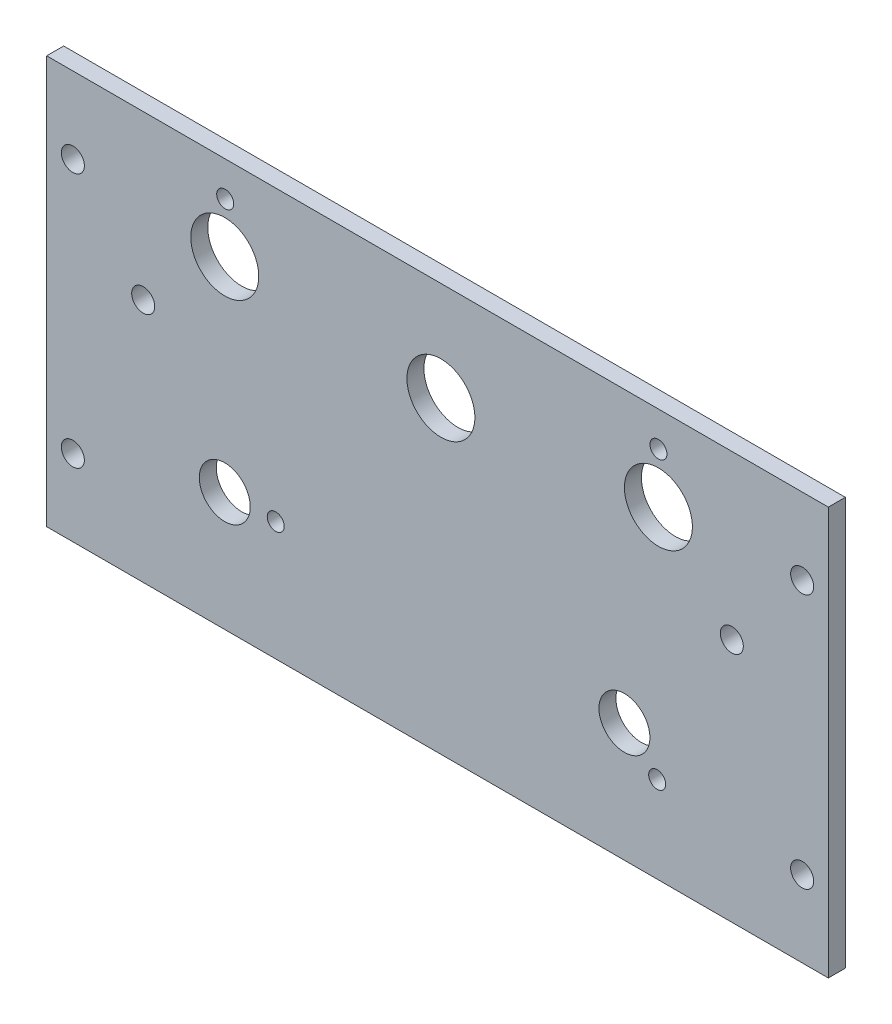
ISO-10303-21;
HEADER;
FILE_DESCRIPTION(('STEP AP214'),'2;1');
FILE_NAME('part.step','',(''),(''),'','','');
FILE_SCHEMA(('AUTOMOTIVE_DESIGN { 1 0 10303 214 1 1 1 1 }'));
ENDSEC;
DATA;
#1=APPLICATION_CONTEXT('core data for automotive mechanical design processes');
#2=APPLICATION_PROTOCOL_DEFINITION('international standard','automotive_design',2000,#1);
#3=PRODUCT_CONTEXT('',#1,'mechanical');
#4=PRODUCT('Part','Part','',(#3));
#5=PRODUCT_RELATED_PRODUCT_CATEGORY('part','',(#4));
#6=PRODUCT_DEFINITION_FORMATION('','',#4);
#7=PRODUCT_DEFINITION_CONTEXT('part definition',#1,'design');
#8=PRODUCT_DEFINITION('design','',#6,#7);
#9=PRODUCT_DEFINITION_SHAPE('','',#8);
#10=(LENGTH_UNIT() NAMED_UNIT(*) SI_UNIT(.MILLI.,.METRE.));
#11=(NAMED_UNIT(*) PLANE_ANGLE_UNIT() SI_UNIT($,.RADIAN.));
#12=(NAMED_UNIT(*) SI_UNIT($,.STERADIAN.) SOLID_ANGLE_UNIT());
#13=UNCERTAINTY_MEASURE_WITH_UNIT(LENGTH_MEASURE(1.E-05),#10,'distance_accuracy_value','');
#14=(GEOMETRIC_REPRESENTATION_CONTEXT(3) GLOBAL_UNCERTAINTY_ASSIGNED_CONTEXT((#13)) GLOBAL_UNIT_ASSIGNED_CONTEXT((#10,
#11,#12)) REPRESENTATION_CONTEXT('',''));
#15=CARTESIAN_POINT('',(0.,0.,0.));
#16=DIRECTION('',(0.,0.,1.));
#17=DIRECTION('',(1.,0.,0.));
#18=AXIS2_PLACEMENT_3D('',#15,#16,#17);
#19=CARTESIAN_POINT('',(0.,0.,-3.175));
#20=DIRECTION('',(1.,0.,0.));
#21=DIRECTION('',(0.,1.,0.));
#22=AXIS2_PLACEMENT_3D('',#19,#20,#21);
#23=PLANE('',#22);
#24=DIRECTION('',(0.,1.,0.));
#25=VECTOR('',#24,1.);
#26=CARTESIAN_POINT('',(0.,0.,0.));
#27=LINE('',#26,#25);
#28=CARTESIAN_POINT('',(0.,0.,0.));
#29=VERTEX_POINT('',#28);
#30=CARTESIAN_POINT('',(0.,76.2,0.));
#31=VERTEX_POINT('',#30);
#32=EDGE_CURVE('E118',#29,#31,#27,.T.);
#33=ORIENTED_EDGE('',*,*,#32,.F.);
#34=DIRECTION('',(0.,0.,1.));
#35=VECTOR('',#34,1.);
#36=CARTESIAN_POINT('',(0.,0.,-3.175));
#37=LINE('',#36,#35);
#38=CARTESIAN_POINT('',(0.,0.,-3.175));
#39=VERTEX_POINT('',#38);
#40=EDGE_CURVE('E13',#39,#29,#37,.T.);
#41=ORIENTED_EDGE('',*,*,#40,.F.);
#42=DIRECTION('',(0.,1.,0.));
#43=VECTOR('',#42,1.);
#44=CARTESIAN_POINT('',(0.,0.,-3.175));
#45=LINE('',#44,#43);
#46=CARTESIAN_POINT('',(0.,76.2,-3.175));
#47=VERTEX_POINT('',#46);
#48=EDGE_CURVE('E111',#39,#47,#45,.T.);
#49=ORIENTED_EDGE('',*,*,#48,.T.);
#50=DIRECTION('',(0.,0.,1.));
#51=VECTOR('',#50,1.);
#52=CARTESIAN_POINT('',(0.,76.2,-3.175));
#53=LINE('',#52,#51);
#54=EDGE_CURVE('E56',#47,#31,#53,.T.);
#55=ORIENTED_EDGE('',*,*,#54,.T.);
#56=EDGE_LOOP('',(#33,#41,#49,#55));
#57=FACE_BOUND('',#56,.T.);
#58=ADVANCED_FACE('F53',(#57),#23,.T.);
#59=CARTESIAN_POINT('',(-146.05,0.,-3.175));
#60=DIRECTION('',(0.,-1.,0.));
#61=DIRECTION('',(1.,0.,0.));
#62=AXIS2_PLACEMENT_3D('',#59,#60,#61);
#63=PLANE('',#62);
#64=DIRECTION('',(1.,0.,0.));
#65=VECTOR('',#64,1.);
#66=CARTESIAN_POINT('',(-146.05,0.,0.));
#67=LINE('',#66,#65);
#68=CARTESIAN_POINT('',(-146.05,0.,0.));
#69=VERTEX_POINT('',#68);
#70=EDGE_CURVE('E113',#69,#29,#67,.T.);
#71=ORIENTED_EDGE('',*,*,#70,.F.);
#72=DIRECTION('',(0.,0.,1.));
#73=VECTOR('',#72,1.);
#74=CARTESIAN_POINT('',(-146.05,0.,-3.175));
#75=LINE('',#74,#73);
#76=CARTESIAN_POINT('',(-146.05,0.,-3.175));
#77=VERTEX_POINT('',#76);
#78=EDGE_CURVE('E62',#77,#69,#75,.T.);
#79=ORIENTED_EDGE('',*,*,#78,.F.);
#80=DIRECTION('',(1.,0.,0.));
#81=VECTOR('',#80,1.);
#82=CARTESIAN_POINT('',(-146.05,0.,-3.175));
#83=LINE('',#82,#81);
#84=EDGE_CURVE('E108',#77,#39,#83,.T.);
#85=ORIENTED_EDGE('',*,*,#84,.T.);
#86=ORIENTED_EDGE('',*,*,#40,.T.);
#87=EDGE_LOOP('',(#71,#79,#85,#86));
#88=FACE_BOUND('',#87,.T.);
#89=ADVANCED_FACE('F129',(#88),#63,.T.);
#90=CARTESIAN_POINT('',(-146.05,76.2,-3.175));
#91=DIRECTION('',(-1.,0.,0.));
#92=DIRECTION('',(0.,0.,1.));
#93=AXIS2_PLACEMENT_3D('',#90,#91,#92);
#94=PLANE('',#93);
#95=DIRECTION('',(0.,-1.,0.));
#96=VECTOR('',#95,1.);
#97=CARTESIAN_POINT('',(-146.05,76.2,0.));
#98=LINE('',#97,#96);
#99=CARTESIAN_POINT('',(-146.05,76.2,0.));
#100=VERTEX_POINT('',#99);
#101=EDGE_CURVE('E103',#100,#69,#98,.T.);
#102=ORIENTED_EDGE('',*,*,#101,.F.);
#103=DIRECTION('',(0.,0.,1.));
#104=VECTOR('',#103,1.);
#105=CARTESIAN_POINT('',(-146.05,76.2,-3.175));
#106=LINE('',#105,#104);
#107=CARTESIAN_POINT('',(-146.05,76.2,-3.175));
#108=VERTEX_POINT('',#107);
#109=EDGE_CURVE('E98',#108,#100,#106,.T.);
#110=ORIENTED_EDGE('',*,*,#109,.F.);
#111=DIRECTION('',(0.,-1.,0.));
#112=VECTOR('',#111,1.);
#113=CARTESIAN_POINT('',(-146.05,76.2,-3.175));
#114=LINE('',#113,#112);
#115=EDGE_CURVE('E101',#108,#77,#114,.T.);
#116=ORIENTED_EDGE('',*,*,#115,.T.);
#117=ORIENTED_EDGE('',*,*,#78,.T.);
#118=EDGE_LOOP('',(#102,#110,#116,#117));
#119=FACE_BOUND('',#118,.T.);
#120=ADVANCED_FACE('F100',(#119),#94,.T.);
#121=CARTESIAN_POINT('',(0.,76.2,-3.175));
#122=DIRECTION('',(0.,1.,0.));
#123=DIRECTION('',(-1.,0.,0.));
#124=AXIS2_PLACEMENT_3D('',#121,#122,#123);
#125=PLANE('',#124);
#126=DIRECTION('',(-1.,0.,0.));
#127=VECTOR('',#126,1.);
#128=CARTESIAN_POINT('',(0.,76.2,0.));
#129=LINE('',#128,#127);
#130=EDGE_CURVE('E121',#31,#100,#129,.T.);
#131=ORIENTED_EDGE('',*,*,#130,.F.);
#132=ORIENTED_EDGE('',*,*,#54,.F.);
#133=DIRECTION('',(-1.,0.,0.));
#134=VECTOR('',#133,1.);
#135=CARTESIAN_POINT('',(0.,76.2,-3.175));
#136=LINE('',#135,#134);
#137=EDGE_CURVE('E107',#47,#108,#136,.T.);
#138=ORIENTED_EDGE('',*,*,#137,.T.);
#139=ORIENTED_EDGE('',*,*,#109,.T.);
#140=EDGE_LOOP('',(#131,#132,#138,#139));
#141=FACE_BOUND('',#140,.T.);
#142=ADVANCED_FACE('F110',(#141),#125,.T.);
#143=CARTESIAN_POINT('',(0.,0.,-3.175));
#144=DIRECTION('',(0.,0.,1.));
#145=DIRECTION('',(1.,0.,0.));
#146=AXIS2_PLACEMENT_3D('',#143,#144,#145);
#147=PLANE('',#146);
#148=CARTESIAN_POINT('',(-31.75,69.6994920669714,-3.175));
#149=DIRECTION('',(0.,0.,-1.));
#150=DIRECTION('',(-1.,0.,0.));
#151=AXIS2_PLACEMENT_3D('',#148,#149,#150);
#152=CIRCLE('',#151,1.5875);
#153=CARTESIAN_POINT('',(-33.3375,69.6994920669714,-3.175));
#154=VERTEX_POINT('',#153);
#155=EDGE_CURVE('E217',#154,#154,#152,.T.);
#156=ORIENTED_EDGE('',*,*,#155,.F.);
#157=EDGE_LOOP('',(#156));
#158=FACE_BOUND('',#157,.T.);
#159=CARTESIAN_POINT('',(-112.69543144651,69.6994920669714,-3.175));
#160=DIRECTION('',(0.,0.,-1.));
#161=DIRECTION('',(-1.,0.,0.));
#162=AXIS2_PLACEMENT_3D('',#159,#160,#161);
#163=CIRCLE('',#162,1.58749999999999);
#164=CARTESIAN_POINT('',(-114.28293144651,69.6994920669714,-3.175));
#165=VERTEX_POINT('',#164);
#166=EDGE_CURVE('E219',#165,#165,#163,.T.);
#167=ORIENTED_EDGE('',*,*,#166,.F.);
#168=EDGE_LOOP('',(#167));
#169=FACE_BOUND('',#168,.T.);
#170=CARTESIAN_POINT('',(-103.251,22.225,-3.175));
#171=DIRECTION('',(0.,0.,-1.));
#172=DIRECTION('',(-1.,0.,0.));
#173=AXIS2_PLACEMENT_3D('',#170,#171,#172);
#174=CIRCLE('',#173,1.58749999999999);
#175=CARTESIAN_POINT('',(-104.8385,22.225,-3.175));
#176=VERTEX_POINT('',#175);
#177=EDGE_CURVE('E227',#176,#176,#174,.T.);
#178=ORIENTED_EDGE('',*,*,#177,.F.);
#179=EDGE_LOOP('',(#178));
#180=FACE_BOUND('',#179,.T.);
#181=CARTESIAN_POINT('',(-31.9806747602245,16.1303467638656,-3.175));
#182=DIRECTION('',(0.,0.,-1.));
#183=DIRECTION('',(-1.,0.,0.));
#184=AXIS2_PLACEMENT_3D('',#181,#182,#183);
#185=CIRCLE('',#184,1.5875);
#186=CARTESIAN_POINT('',(-33.5681747602245,16.1303467638656,-3.175));
#187=VERTEX_POINT('',#186);
#188=EDGE_CURVE('E233',#187,#187,#185,.T.);
#189=ORIENTED_EDGE('',*,*,#188,.F.);
#190=EDGE_LOOP('',(#189));
#191=FACE_BOUND('',#190,.T.);
#192=CARTESIAN_POINT('',(-38.1,22.225,-3.175));
#193=DIRECTION('',(0.,0.,-1.));
#194=DIRECTION('',(-1.,0.,0.));
#195=AXIS2_PLACEMENT_3D('',#192,#193,#194);
#196=CIRCLE('',#195,4.7625);
#197=CARTESIAN_POINT('',(-42.8625,22.225,-3.175));
#198=VERTEX_POINT('',#197);
#199=EDGE_CURVE('E239',#198,#198,#196,.T.);
#200=ORIENTED_EDGE('',*,*,#199,.F.);
#201=EDGE_LOOP('',(#200));
#202=FACE_BOUND('',#201,.T.);
#203=CARTESIAN_POINT('',(-112.776,22.225,-3.175));
#204=DIRECTION('',(0.,0.,-1.));
#205=DIRECTION('',(-1.,0.,0.));
#206=AXIS2_PLACEMENT_3D('',#203,#204,#205);
#207=CIRCLE('',#206,4.7625);
#208=CARTESIAN_POINT('',(-117.5385,22.225,-3.175));
#209=VERTEX_POINT('',#208);
#210=EDGE_CURVE('E245',#209,#209,#207,.T.);
#211=ORIENTED_EDGE('',*,*,#210,.F.);
#212=EDGE_LOOP('',(#211));
#213=FACE_BOUND('',#212,.T.);
#214=CARTESIAN_POINT('',(-31.75,60.325,-3.175));
#215=DIRECTION('',(0.,0.,-1.));
#216=DIRECTION('',(-1.,0.,0.));
#217=AXIS2_PLACEMENT_3D('',#214,#215,#216);
#218=CIRCLE('',#217,6.35);
#219=CARTESIAN_POINT('',(-38.1,60.325,-3.175));
#220=VERTEX_POINT('',#219);
#221=EDGE_CURVE('E251',#220,#220,#218,.T.);
#222=ORIENTED_EDGE('',*,*,#221,.F.);
#223=EDGE_LOOP('',(#222));
#224=FACE_BOUND('',#223,.T.);
#225=CARTESIAN_POINT('',(-72.39,57.658,-3.175));
#226=DIRECTION('',(0.,0.,-1.));
#227=DIRECTION('',(-1.,0.,0.));
#228=AXIS2_PLACEMENT_3D('',#225,#226,#227);
#229=CIRCLE('',#228,6.34999999999999);
#230=CARTESIAN_POINT('',(-78.74,57.658,-3.175));
#231=VERTEX_POINT('',#230);
#232=EDGE_CURVE('E257',#231,#231,#229,.T.);
#233=ORIENTED_EDGE('',*,*,#232,.F.);
#234=EDGE_LOOP('',(#233));
#235=FACE_BOUND('',#234,.T.);
#236=CARTESIAN_POINT('',(-112.776,60.325,-3.175));
#237=DIRECTION('',(0.,0.,-1.));
#238=DIRECTION('',(-1.,0.,0.));
#239=AXIS2_PLACEMENT_3D('',#236,#237,#238);
#240=CIRCLE('',#239,6.34999999999999);
#241=CARTESIAN_POINT('',(-119.126,60.325,-3.175));
#242=VERTEX_POINT('',#241);
#243=EDGE_CURVE('E263',#242,#242,#240,.T.);
#244=ORIENTED_EDGE('',*,*,#243,.F.);
#245=EDGE_LOOP('',(#244));
#246=FACE_BOUND('',#245,.T.);
#247=CARTESIAN_POINT('',(-4.88949999999997,61.9125,-3.175));
#248=DIRECTION('',(0.,0.,-1.));
#249=DIRECTION('',(-1.,0.,0.));
#250=AXIS2_PLACEMENT_3D('',#247,#248,#249);
#251=CIRCLE('',#250,2.15264999999999);
#252=CARTESIAN_POINT('',(-7.04214999999996,61.9125,-3.175));
#253=VERTEX_POINT('',#252);
#254=EDGE_CURVE('E269',#253,#253,#251,.T.);
#255=ORIENTED_EDGE('',*,*,#254,.F.);
#256=EDGE_LOOP('',(#255));
#257=FACE_BOUND('',#256,.T.);
#258=CARTESIAN_POINT('',(-4.88949999999995,14.2875,-3.175));
#259=DIRECTION('',(0.,0.,-1.));
#260=DIRECTION('',(-1.,0.,0.));
#261=AXIS2_PLACEMENT_3D('',#258,#259,#260);
#262=CIRCLE('',#261,2.15264999999999);
#263=CARTESIAN_POINT('',(-7.04214999999994,14.2875,-3.175));
#264=VERTEX_POINT('',#263);
#265=EDGE_CURVE('E275',#264,#264,#262,.T.);
#266=ORIENTED_EDGE('',*,*,#265,.F.);
#267=EDGE_LOOP('',(#266));
#268=FACE_BOUND('',#267,.T.);
#269=CARTESIAN_POINT('',(-141.1605,14.2875,-3.175));
#270=DIRECTION('',(0.,0.,-1.));
#271=DIRECTION('',(-1.,0.,0.));
#272=AXIS2_PLACEMENT_3D('',#269,#270,#271);
#273=CIRCLE('',#272,2.15264999999998);
#274=CARTESIAN_POINT('',(-143.31315,14.2875,-3.175));
#275=VERTEX_POINT('',#274);
#276=EDGE_CURVE('E281',#275,#275,#273,.T.);
#277=ORIENTED_EDGE('',*,*,#276,.F.);
#278=EDGE_LOOP('',(#277));
#279=FACE_BOUND('',#278,.T.);
#280=CARTESIAN_POINT('',(-141.1605,61.9125,-3.175));
#281=DIRECTION('',(0.,0.,-1.));
#282=DIRECTION('',(-1.,0.,0.));
#283=AXIS2_PLACEMENT_3D('',#280,#281,#282);
#284=CIRCLE('',#283,2.15264999999998);
#285=CARTESIAN_POINT('',(-143.31315,61.9125,-3.175));
#286=VERTEX_POINT('',#285);
#287=EDGE_CURVE('E287',#286,#286,#284,.T.);
#288=ORIENTED_EDGE('',*,*,#287,.F.);
#289=EDGE_LOOP('',(#288));
#290=FACE_BOUND('',#289,.T.);
#291=CARTESIAN_POINT('',(-128.016,45.72,-3.175));
#292=DIRECTION('',(0.,0.,-1.));
#293=DIRECTION('',(-1.,0.,0.));
#294=AXIS2_PLACEMENT_3D('',#291,#292,#293);
#295=CIRCLE('',#294,2.15264999999998);
#296=CARTESIAN_POINT('',(-130.16865,45.72,-3.175));
#297=VERTEX_POINT('',#296);
#298=EDGE_CURVE('E293',#297,#297,#295,.T.);
#299=ORIENTED_EDGE('',*,*,#298,.F.);
#300=EDGE_LOOP('',(#299));
#301=FACE_BOUND('',#300,.T.);
#302=CARTESIAN_POINT('',(-18.034,45.72,-3.175));
#303=DIRECTION('',(0.,0.,-1.));
#304=DIRECTION('',(-1.,0.,0.));
#305=AXIS2_PLACEMENT_3D('',#302,#303,#304);
#306=CIRCLE('',#305,2.15264999999999);
#307=CARTESIAN_POINT('',(-20.18665,45.72,-3.175));
#308=VERTEX_POINT('',#307);
#309=EDGE_CURVE('E299',#308,#308,#306,.T.);
#310=ORIENTED_EDGE('',*,*,#309,.F.);
#311=EDGE_LOOP('',(#310));
#312=FACE_BOUND('',#311,.T.);
#313=ORIENTED_EDGE('',*,*,#48,.F.);
#314=ORIENTED_EDGE('',*,*,#84,.F.);
#315=ORIENTED_EDGE('',*,*,#115,.F.);
#316=ORIENTED_EDGE('',*,*,#137,.F.);
#317=EDGE_LOOP('',(#313,#314,#315,#316));
#318=FACE_BOUND('',#317,.T.);
#319=ADVANCED_FACE('F106',(#158,#169,#180,#191,#202,#213,#224,#235,#246,#257,#268,#279,#290,
#301,#312,#318),#147,.F.);
#320=CARTESIAN_POINT('',(0.,0.,0.));
#321=DIRECTION('',(0.,0.,1.));
#322=DIRECTION('',(1.,0.,0.));
#323=AXIS2_PLACEMENT_3D('',#320,#321,#322);
#324=PLANE('',#323);
#325=CARTESIAN_POINT('',(-31.75,69.6994920669714,0.));
#326=DIRECTION('',(0.,0.,-1.));
#327=DIRECTION('',(-1.,0.,0.));
#328=AXIS2_PLACEMENT_3D('',#325,#326,#327);
#329=CIRCLE('',#328,1.5875);
#330=CARTESIAN_POINT('',(-33.3375,69.6994920669714,0.));
#331=VERTEX_POINT('',#330);
#332=EDGE_CURVE('E215',#331,#331,#329,.T.);
#333=ORIENTED_EDGE('',*,*,#332,.T.);
#334=EDGE_LOOP('',(#333));
#335=FACE_BOUND('',#334,.T.);
#336=CARTESIAN_POINT('',(-112.69543144651,69.6994920669714,0.));
#337=DIRECTION('',(0.,0.,-1.));
#338=DIRECTION('',(-1.,0.,0.));
#339=AXIS2_PLACEMENT_3D('',#336,#337,#338);
#340=CIRCLE('',#339,1.58749999999999);
#341=CARTESIAN_POINT('',(-114.28293144651,69.6994920669714,0.));
#342=VERTEX_POINT('',#341);
#343=EDGE_CURVE('E224',#342,#342,#340,.T.);
#344=ORIENTED_EDGE('',*,*,#343,.T.);
#345=EDGE_LOOP('',(#344));
#346=FACE_BOUND('',#345,.T.);
#347=CARTESIAN_POINT('',(-103.251,22.225,0.));
#348=DIRECTION('',(0.,0.,-1.));
#349=DIRECTION('',(-1.,0.,0.));
#350=AXIS2_PLACEMENT_3D('',#347,#348,#349);
#351=CIRCLE('',#350,1.58749999999999);
#352=CARTESIAN_POINT('',(-104.8385,22.225,0.));
#353=VERTEX_POINT('',#352);
#354=EDGE_CURVE('E230',#353,#353,#351,.T.);
#355=ORIENTED_EDGE('',*,*,#354,.T.);
#356=EDGE_LOOP('',(#355));
#357=FACE_BOUND('',#356,.T.);
#358=CARTESIAN_POINT('',(-31.9806747602245,16.1303467638656,0.));
#359=DIRECTION('',(0.,0.,-1.));
#360=DIRECTION('',(-1.,0.,0.));
#361=AXIS2_PLACEMENT_3D('',#358,#359,#360);
#362=CIRCLE('',#361,1.5875);
#363=CARTESIAN_POINT('',(-33.5681747602245,16.1303467638656,0.));
#364=VERTEX_POINT('',#363);
#365=EDGE_CURVE('E236',#364,#364,#362,.T.);
#366=ORIENTED_EDGE('',*,*,#365,.T.);
#367=EDGE_LOOP('',(#366));
#368=FACE_BOUND('',#367,.T.);
#369=CARTESIAN_POINT('',(-38.1,22.225,0.));
#370=DIRECTION('',(0.,0.,-1.));
#371=DIRECTION('',(-1.,0.,0.));
#372=AXIS2_PLACEMENT_3D('',#369,#370,#371);
#373=CIRCLE('',#372,4.7625);
#374=CARTESIAN_POINT('',(-42.8625,22.225,0.));
#375=VERTEX_POINT('',#374);
#376=EDGE_CURVE('E242',#375,#375,#373,.T.);
#377=ORIENTED_EDGE('',*,*,#376,.T.);
#378=EDGE_LOOP('',(#377));
#379=FACE_BOUND('',#378,.T.);
#380=CARTESIAN_POINT('',(-112.776,22.225,0.));
#381=DIRECTION('',(0.,0.,-1.));
#382=DIRECTION('',(-1.,0.,0.));
#383=AXIS2_PLACEMENT_3D('',#380,#381,#382);
#384=CIRCLE('',#383,4.7625);
#385=CARTESIAN_POINT('',(-117.5385,22.225,0.));
#386=VERTEX_POINT('',#385);
#387=EDGE_CURVE('E248',#386,#386,#384,.T.);
#388=ORIENTED_EDGE('',*,*,#387,.T.);
#389=EDGE_LOOP('',(#388));
#390=FACE_BOUND('',#389,.T.);
#391=CARTESIAN_POINT('',(-31.75,60.325,0.));
#392=DIRECTION('',(0.,0.,-1.));
#393=DIRECTION('',(-1.,0.,0.));
#394=AXIS2_PLACEMENT_3D('',#391,#392,#393);
#395=CIRCLE('',#394,6.35);
#396=CARTESIAN_POINT('',(-38.1,60.325,0.));
#397=VERTEX_POINT('',#396);
#398=EDGE_CURVE('E254',#397,#397,#395,.T.);
#399=ORIENTED_EDGE('',*,*,#398,.T.);
#400=EDGE_LOOP('',(#399));
#401=FACE_BOUND('',#400,.T.);
#402=CARTESIAN_POINT('',(-72.39,57.658,0.));
#403=DIRECTION('',(0.,0.,-1.));
#404=DIRECTION('',(-1.,0.,0.));
#405=AXIS2_PLACEMENT_3D('',#402,#403,#404);
#406=CIRCLE('',#405,6.34999999999999);
#407=CARTESIAN_POINT('',(-78.74,57.658,0.));
#408=VERTEX_POINT('',#407);
#409=EDGE_CURVE('E260',#408,#408,#406,.T.);
#410=ORIENTED_EDGE('',*,*,#409,.T.);
#411=EDGE_LOOP('',(#410));
#412=FACE_BOUND('',#411,.T.);
#413=CARTESIAN_POINT('',(-112.776,60.325,0.));
#414=DIRECTION('',(0.,0.,-1.));
#415=DIRECTION('',(-1.,0.,0.));
#416=AXIS2_PLACEMENT_3D('',#413,#414,#415);
#417=CIRCLE('',#416,6.34999999999999);
#418=CARTESIAN_POINT('',(-119.126,60.325,0.));
#419=VERTEX_POINT('',#418);
#420=EDGE_CURVE('E266',#419,#419,#417,.T.);
#421=ORIENTED_EDGE('',*,*,#420,.T.);
#422=EDGE_LOOP('',(#421));
#423=FACE_BOUND('',#422,.T.);
#424=CARTESIAN_POINT('',(-4.88949999999997,61.9125,0.));
#425=DIRECTION('',(0.,0.,-1.));
#426=DIRECTION('',(-1.,0.,0.));
#427=AXIS2_PLACEMENT_3D('',#424,#425,#426);
#428=CIRCLE('',#427,2.15265);
#429=CARTESIAN_POINT('',(-7.04214999999997,61.9125,0.));
#430=VERTEX_POINT('',#429);
#431=EDGE_CURVE('E272',#430,#430,#428,.T.);
#432=ORIENTED_EDGE('',*,*,#431,.T.);
#433=EDGE_LOOP('',(#432));
#434=FACE_BOUND('',#433,.T.);
#435=CARTESIAN_POINT('',(-4.88949999999995,14.2875,0.));
#436=DIRECTION('',(0.,0.,-1.));
#437=DIRECTION('',(-1.,0.,0.));
#438=AXIS2_PLACEMENT_3D('',#435,#436,#437);
#439=CIRCLE('',#438,2.15265);
#440=CARTESIAN_POINT('',(-7.04214999999995,14.2875,0.));
#441=VERTEX_POINT('',#440);
#442=EDGE_CURVE('E278',#441,#441,#439,.T.);
#443=ORIENTED_EDGE('',*,*,#442,.T.);
#444=EDGE_LOOP('',(#443));
#445=FACE_BOUND('',#444,.T.);
#446=CARTESIAN_POINT('',(-141.1605,14.2875,0.));
#447=DIRECTION('',(0.,0.,-1.));
#448=DIRECTION('',(-1.,0.,0.));
#449=AXIS2_PLACEMENT_3D('',#446,#447,#448);
#450=CIRCLE('',#449,2.15265000000001);
#451=CARTESIAN_POINT('',(-143.31315,14.2875,0.));
#452=VERTEX_POINT('',#451);
#453=EDGE_CURVE('E284',#452,#452,#450,.T.);
#454=ORIENTED_EDGE('',*,*,#453,.T.);
#455=EDGE_LOOP('',(#454));
#456=FACE_BOUND('',#455,.T.);
#457=CARTESIAN_POINT('',(-141.1605,61.9125,0.));
#458=DIRECTION('',(0.,0.,-1.));
#459=DIRECTION('',(-1.,0.,0.));
#460=AXIS2_PLACEMENT_3D('',#457,#458,#459);
#461=CIRCLE('',#460,2.15265000000001);
#462=CARTESIAN_POINT('',(-143.31315,61.9125,0.));
#463=VERTEX_POINT('',#462);
#464=EDGE_CURVE('E290',#463,#463,#461,.T.);
#465=ORIENTED_EDGE('',*,*,#464,.T.);
#466=EDGE_LOOP('',(#465));
#467=FACE_BOUND('',#466,.T.);
#468=CARTESIAN_POINT('',(-128.016,45.72,0.));
#469=DIRECTION('',(0.,0.,-1.));
#470=DIRECTION('',(-1.,0.,0.));
#471=AXIS2_PLACEMENT_3D('',#468,#469,#470);
#472=CIRCLE('',#471,2.15265000000001);
#473=CARTESIAN_POINT('',(-130.16865,45.72,0.));
#474=VERTEX_POINT('',#473);
#475=EDGE_CURVE('E296',#474,#474,#472,.T.);
#476=ORIENTED_EDGE('',*,*,#475,.T.);
#477=EDGE_LOOP('',(#476));
#478=FACE_BOUND('',#477,.T.);
#479=CARTESIAN_POINT('',(-18.034,45.72,0.));
#480=DIRECTION('',(0.,0.,-1.));
#481=DIRECTION('',(-1.,0.,0.));
#482=AXIS2_PLACEMENT_3D('',#479,#480,#481);
#483=CIRCLE('',#482,2.15265);
#484=CARTESIAN_POINT('',(-20.18665,45.72,0.));
#485=VERTEX_POINT('',#484);
#486=EDGE_CURVE('E122',#485,#485,#483,.T.);
#487=ORIENTED_EDGE('',*,*,#486,.T.);
#488=EDGE_LOOP('',(#487));
#489=FACE_BOUND('',#488,.T.);
#490=ORIENTED_EDGE('',*,*,#32,.T.);
#491=ORIENTED_EDGE('',*,*,#130,.T.);
#492=ORIENTED_EDGE('',*,*,#101,.T.);
#493=ORIENTED_EDGE('',*,*,#70,.T.);
#494=EDGE_LOOP('',(#490,#491,#492,#493));
#495=FACE_BOUND('',#494,.T.);
#496=ADVANCED_FACE('F128',(#335,#346,#357,#368,#379,#390,#401,#412,#423,#434,#445,#456,#467,
#478,#489,#495),#324,.T.);
#497=CARTESIAN_POINT('',(-18.034,45.72,-3.175));
#498=DIRECTION('',(0.,0.,-1.));
#499=DIRECTION('',(-1.,0.,0.));
#500=AXIS2_PLACEMENT_3D('',#497,#498,#499);
#501=CYLINDRICAL_SURFACE('',#500,2.15264999999999);
#502=ORIENTED_EDGE('',*,*,#486,.F.);
#503=EDGE_LOOP('',(#502));
#504=FACE_BOUND('',#503,.T.);
#505=ORIENTED_EDGE('',*,*,#309,.T.);
#506=EDGE_LOOP('',(#505));
#507=FACE_BOUND('',#506,.T.);
#508=ADVANCED_FACE('F147',(#504,#507),#501,.F.);
#509=CARTESIAN_POINT('',(-128.016,45.72,-3.175));
#510=DIRECTION('',(0.,0.,-1.));
#511=DIRECTION('',(-1.,0.,0.));
#512=AXIS2_PLACEMENT_3D('',#509,#510,#511);
#513=CYLINDRICAL_SURFACE('',#512,2.15264999999999);
#514=ORIENTED_EDGE('',*,*,#475,.F.);
#515=EDGE_LOOP('',(#514));
#516=FACE_BOUND('',#515,.T.);
#517=ORIENTED_EDGE('',*,*,#298,.T.);
#518=EDGE_LOOP('',(#517));
#519=FACE_BOUND('',#518,.T.);
#520=ADVANCED_FACE('F154',(#516,#519),#513,.F.);
#521=CARTESIAN_POINT('',(-141.1605,61.9125,-3.175));
#522=DIRECTION('',(0.,0.,-1.));
#523=DIRECTION('',(-1.,0.,0.));
#524=AXIS2_PLACEMENT_3D('',#521,#522,#523);
#525=CYLINDRICAL_SURFACE('',#524,2.15264999999999);
#526=ORIENTED_EDGE('',*,*,#464,.F.);
#527=EDGE_LOOP('',(#526));
#528=FACE_BOUND('',#527,.T.);
#529=ORIENTED_EDGE('',*,*,#287,.T.);
#530=EDGE_LOOP('',(#529));
#531=FACE_BOUND('',#530,.T.);
#532=ADVANCED_FACE('F158',(#528,#531),#525,.F.);
#533=CARTESIAN_POINT('',(-141.1605,14.2875,-3.175));
#534=DIRECTION('',(0.,0.,-1.));
#535=DIRECTION('',(-1.,0.,0.));
#536=AXIS2_PLACEMENT_3D('',#533,#534,#535);
#537=CYLINDRICAL_SURFACE('',#536,2.15264999999999);
#538=ORIENTED_EDGE('',*,*,#453,.F.);
#539=EDGE_LOOP('',(#538));
#540=FACE_BOUND('',#539,.T.);
#541=ORIENTED_EDGE('',*,*,#276,.T.);
#542=EDGE_LOOP('',(#541));
#543=FACE_BOUND('',#542,.T.);
#544=ADVANCED_FACE('F162',(#540,#543),#537,.F.);
#545=CARTESIAN_POINT('',(-4.88949999999995,14.2875,-3.175));
#546=DIRECTION('',(0.,0.,-1.));
#547=DIRECTION('',(-1.,0.,0.));
#548=AXIS2_PLACEMENT_3D('',#545,#546,#547);
#549=CYLINDRICAL_SURFACE('',#548,2.15264999999999);
#550=ORIENTED_EDGE('',*,*,#442,.F.);
#551=EDGE_LOOP('',(#550));
#552=FACE_BOUND('',#551,.T.);
#553=ORIENTED_EDGE('',*,*,#265,.T.);
#554=EDGE_LOOP('',(#553));
#555=FACE_BOUND('',#554,.T.);
#556=ADVANCED_FACE('F166',(#552,#555),#549,.F.);
#557=CARTESIAN_POINT('',(-4.88949999999997,61.9125,-3.175));
#558=DIRECTION('',(0.,0.,-1.));
#559=DIRECTION('',(-1.,0.,0.));
#560=AXIS2_PLACEMENT_3D('',#557,#558,#559);
#561=CYLINDRICAL_SURFACE('',#560,2.15264999999999);
#562=ORIENTED_EDGE('',*,*,#431,.F.);
#563=EDGE_LOOP('',(#562));
#564=FACE_BOUND('',#563,.T.);
#565=ORIENTED_EDGE('',*,*,#254,.T.);
#566=EDGE_LOOP('',(#565));
#567=FACE_BOUND('',#566,.T.);
#568=ADVANCED_FACE('F170',(#564,#567),#561,.F.);
#569=CARTESIAN_POINT('',(-112.776,60.325,-3.175));
#570=DIRECTION('',(0.,0.,-1.));
#571=DIRECTION('',(-1.,0.,0.));
#572=AXIS2_PLACEMENT_3D('',#569,#570,#571);
#573=CYLINDRICAL_SURFACE('',#572,6.34999999999999);
#574=ORIENTED_EDGE('',*,*,#420,.F.);
#575=EDGE_LOOP('',(#574));
#576=FACE_BOUND('',#575,.T.);
#577=ORIENTED_EDGE('',*,*,#243,.T.);
#578=EDGE_LOOP('',(#577));
#579=FACE_BOUND('',#578,.T.);
#580=ADVANCED_FACE('F174',(#576,#579),#573,.F.);
#581=CARTESIAN_POINT('',(-72.39,57.658,-3.175));
#582=DIRECTION('',(0.,0.,-1.));
#583=DIRECTION('',(-1.,0.,0.));
#584=AXIS2_PLACEMENT_3D('',#581,#582,#583);
#585=CYLINDRICAL_SURFACE('',#584,6.34999999999999);
#586=ORIENTED_EDGE('',*,*,#409,.F.);
#587=EDGE_LOOP('',(#586));
#588=FACE_BOUND('',#587,.T.);
#589=ORIENTED_EDGE('',*,*,#232,.T.);
#590=EDGE_LOOP('',(#589));
#591=FACE_BOUND('',#590,.T.);
#592=ADVANCED_FACE('F178',(#588,#591),#585,.F.);
#593=CARTESIAN_POINT('',(-31.75,60.325,-3.175));
#594=DIRECTION('',(0.,0.,-1.));
#595=DIRECTION('',(-1.,0.,0.));
#596=AXIS2_PLACEMENT_3D('',#593,#594,#595);
#597=CYLINDRICAL_SURFACE('',#596,6.35);
#598=ORIENTED_EDGE('',*,*,#398,.F.);
#599=EDGE_LOOP('',(#598));
#600=FACE_BOUND('',#599,.T.);
#601=ORIENTED_EDGE('',*,*,#221,.T.);
#602=EDGE_LOOP('',(#601));
#603=FACE_BOUND('',#602,.T.);
#604=ADVANCED_FACE('F182',(#600,#603),#597,.F.);
#605=CARTESIAN_POINT('',(-112.776,22.225,-3.175));
#606=DIRECTION('',(0.,0.,-1.));
#607=DIRECTION('',(-1.,0.,0.));
#608=AXIS2_PLACEMENT_3D('',#605,#606,#607);
#609=CYLINDRICAL_SURFACE('',#608,4.7625);
#610=ORIENTED_EDGE('',*,*,#387,.F.);
#611=EDGE_LOOP('',(#610));
#612=FACE_BOUND('',#611,.T.);
#613=ORIENTED_EDGE('',*,*,#210,.T.);
#614=EDGE_LOOP('',(#613));
#615=FACE_BOUND('',#614,.T.);
#616=ADVANCED_FACE('F186',(#612,#615),#609,.F.);
#617=CARTESIAN_POINT('',(-38.1,22.225,-3.175));
#618=DIRECTION('',(0.,0.,-1.));
#619=DIRECTION('',(-1.,0.,0.));
#620=AXIS2_PLACEMENT_3D('',#617,#618,#619);
#621=CYLINDRICAL_SURFACE('',#620,4.7625);
#622=ORIENTED_EDGE('',*,*,#376,.F.);
#623=EDGE_LOOP('',(#622));
#624=FACE_BOUND('',#623,.T.);
#625=ORIENTED_EDGE('',*,*,#199,.T.);
#626=EDGE_LOOP('',(#625));
#627=FACE_BOUND('',#626,.T.);
#628=ADVANCED_FACE('F190',(#624,#627),#621,.F.);
#629=CARTESIAN_POINT('',(-31.9806747602245,16.1303467638656,-3.175));
#630=DIRECTION('',(0.,0.,-1.));
#631=DIRECTION('',(-1.,0.,0.));
#632=AXIS2_PLACEMENT_3D('',#629,#630,#631);
#633=CYLINDRICAL_SURFACE('',#632,1.5875);
#634=ORIENTED_EDGE('',*,*,#365,.F.);
#635=EDGE_LOOP('',(#634));
#636=FACE_BOUND('',#635,.T.);
#637=ORIENTED_EDGE('',*,*,#188,.T.);
#638=EDGE_LOOP('',(#637));
#639=FACE_BOUND('',#638,.T.);
#640=ADVANCED_FACE('F194',(#636,#639),#633,.F.);
#641=CARTESIAN_POINT('',(-103.251,22.225,-3.175));
#642=DIRECTION('',(0.,0.,-1.));
#643=DIRECTION('',(-1.,0.,0.));
#644=AXIS2_PLACEMENT_3D('',#641,#642,#643);
#645=CYLINDRICAL_SURFACE('',#644,1.58749999999999);
#646=ORIENTED_EDGE('',*,*,#354,.F.);
#647=EDGE_LOOP('',(#646));
#648=FACE_BOUND('',#647,.T.);
#649=ORIENTED_EDGE('',*,*,#177,.T.);
#650=EDGE_LOOP('',(#649));
#651=FACE_BOUND('',#650,.T.);
#652=ADVANCED_FACE('F198',(#648,#651),#645,.F.);
#653=CARTESIAN_POINT('',(-112.69543144651,69.6994920669714,-3.175));
#654=DIRECTION('',(0.,0.,-1.));
#655=DIRECTION('',(-1.,0.,0.));
#656=AXIS2_PLACEMENT_3D('',#653,#654,#655);
#657=CYLINDRICAL_SURFACE('',#656,1.58749999999999);
#658=ORIENTED_EDGE('',*,*,#343,.F.);
#659=EDGE_LOOP('',(#658));
#660=FACE_BOUND('',#659,.T.);
#661=ORIENTED_EDGE('',*,*,#166,.T.);
#662=EDGE_LOOP('',(#661));
#663=FACE_BOUND('',#662,.T.);
#664=ADVANCED_FACE('F202',(#660,#663),#657,.F.);
#665=CARTESIAN_POINT('',(-31.75,69.6994920669714,-3.175));
#666=DIRECTION('',(0.,0.,-1.));
#667=DIRECTION('',(-1.,0.,0.));
#668=AXIS2_PLACEMENT_3D('',#665,#666,#667);
#669=CYLINDRICAL_SURFACE('',#668,1.5875);
#670=ORIENTED_EDGE('',*,*,#332,.F.);
#671=EDGE_LOOP('',(#670));
#672=FACE_BOUND('',#671,.T.);
#673=ORIENTED_EDGE('',*,*,#155,.T.);
#674=EDGE_LOOP('',(#673));
#675=FACE_BOUND('',#674,.T.);
#676=ADVANCED_FACE('F206',(#672,#675),#669,.F.);
#677=CLOSED_SHELL('',(#58,#89,#120,#142,#319,#496,#508,#520,#532,#544,#556,#568,#580,#592,#604,
#616,#628,#640,#652,#664,#676));
#678=MANIFOLD_SOLID_BREP('B2',#677);
#679=ADVANCED_BREP_SHAPE_REPRESENTATION('',(#18,#678),#14);
#680=SHAPE_DEFINITION_REPRESENTATION(#9,#679);
ENDSEC;
END-ISO-10303-21;
